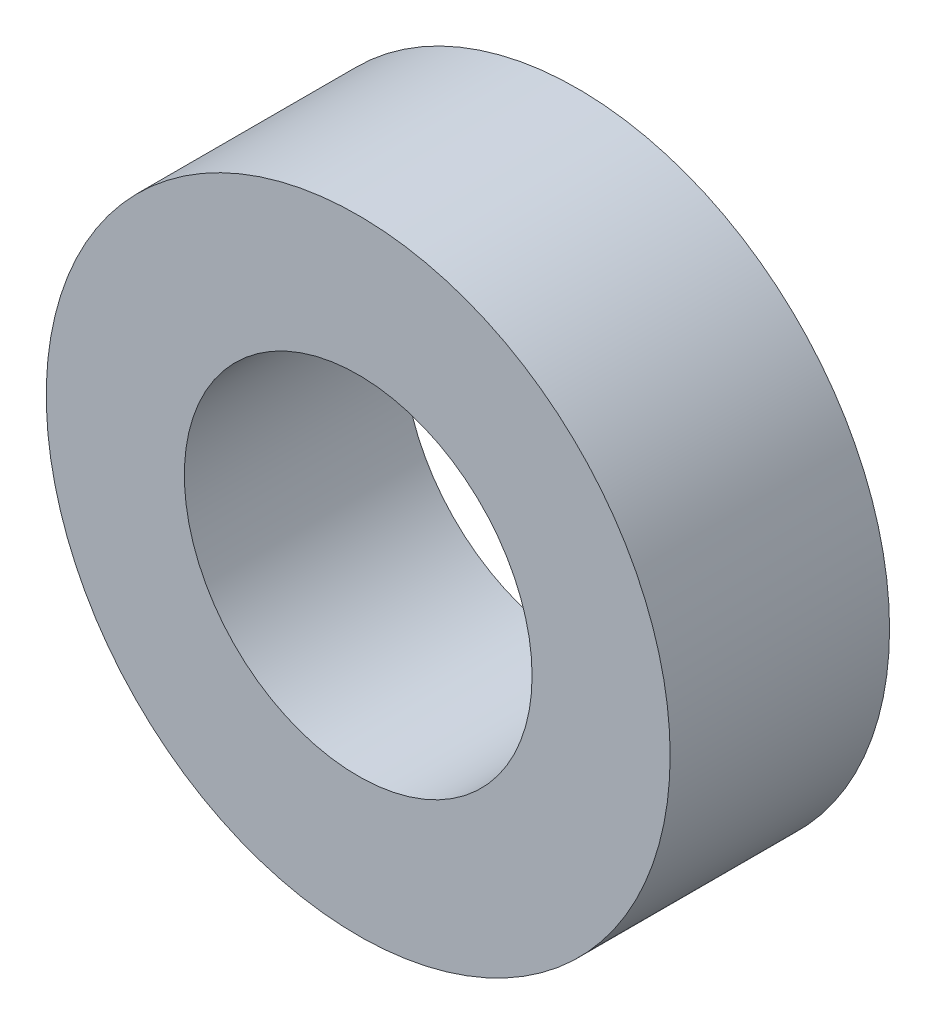
ISO-10303-21;
HEADER;
FILE_DESCRIPTION(('STEP AP214'),'2;1');
FILE_NAME('part.step','',(''),(''),'','','');
FILE_SCHEMA(('AUTOMOTIVE_DESIGN { 1 0 10303 214 1 1 1 1 }'));
ENDSEC;
DATA;
#1=APPLICATION_CONTEXT('core data for automotive mechanical design processes');
#2=APPLICATION_PROTOCOL_DEFINITION('international standard','automotive_design',2000,#1);
#3=PRODUCT_CONTEXT('',#1,'mechanical');
#4=PRODUCT('Part','Part','',(#3));
#5=PRODUCT_RELATED_PRODUCT_CATEGORY('part','',(#4));
#6=PRODUCT_DEFINITION_FORMATION('','',#4);
#7=PRODUCT_DEFINITION_CONTEXT('part definition',#1,'design');
#8=PRODUCT_DEFINITION('design','',#6,#7);
#9=PRODUCT_DEFINITION_SHAPE('','',#8);
#10=(LENGTH_UNIT() NAMED_UNIT(*) SI_UNIT(.MILLI.,.METRE.));
#11=(NAMED_UNIT(*) PLANE_ANGLE_UNIT() SI_UNIT($,.RADIAN.));
#12=(NAMED_UNIT(*) SI_UNIT($,.STERADIAN.) SOLID_ANGLE_UNIT());
#13=UNCERTAINTY_MEASURE_WITH_UNIT(LENGTH_MEASURE(1.E-05),#10,'distance_accuracy_value','');
#14=(GEOMETRIC_REPRESENTATION_CONTEXT(3) GLOBAL_UNCERTAINTY_ASSIGNED_CONTEXT((#13)) GLOBAL_UNIT_ASSIGNED_CONTEXT((#10,
#11,#12)) REPRESENTATION_CONTEXT('',''));
#15=CARTESIAN_POINT('',(0.,0.,0.));
#16=DIRECTION('',(0.,0.,1.));
#17=DIRECTION('',(1.,0.,0.));
#18=AXIS2_PLACEMENT_3D('',#15,#16,#17);
#19=CARTESIAN_POINT('',(0.,0.,50.8));
#20=DIRECTION('',(0.,0.,1.));
#21=DIRECTION('',(1.,0.,0.));
#22=AXIS2_PLACEMENT_3D('',#19,#20,#21);
#23=PLANE('',#22);
#24=CARTESIAN_POINT('',(0.,0.,50.8));
#25=DIRECTION('',(0.,0.,1.));
#26=DIRECTION('',(1.,0.,0.));
#27=AXIS2_PLACEMENT_3D('',#24,#25,#26);
#28=CIRCLE('',#27,72.23125);
#29=CARTESIAN_POINT('',(72.23125,0.,50.8));
#30=VERTEX_POINT('',#29);
#31=EDGE_CURVE('E10',#30,#30,#28,.T.);
#32=ORIENTED_EDGE('',*,*,#31,.T.);
#33=EDGE_LOOP('',(#32));
#34=FACE_BOUND('',#33,.T.);
#35=CARTESIAN_POINT('',(0.,0.,50.8));
#36=DIRECTION('',(0.,0.,1.));
#37=DIRECTION('',(1.,0.,0.));
#38=AXIS2_PLACEMENT_3D('',#35,#36,#37);
#39=CIRCLE('',#38,40.259);
#40=CARTESIAN_POINT('',(40.259,0.,50.8));
#41=VERTEX_POINT('',#40);
#42=EDGE_CURVE('E42',#41,#41,#39,.T.);
#43=ORIENTED_EDGE('',*,*,#42,.F.);
#44=EDGE_LOOP('',(#43));
#45=FACE_BOUND('',#44,.T.);
#46=ADVANCED_FACE('F31',(#34,#45),#23,.T.);
#47=CARTESIAN_POINT('',(0.,0.,0.));
#48=DIRECTION('',(0.,0.,1.));
#49=DIRECTION('',(1.,0.,0.));
#50=AXIS2_PLACEMENT_3D('',#47,#48,#49);
#51=PLANE('',#50);
#52=CARTESIAN_POINT('',(0.,0.,0.));
#53=DIRECTION('',(0.,0.,1.));
#54=DIRECTION('',(1.,0.,0.));
#55=AXIS2_PLACEMENT_3D('',#52,#53,#54);
#56=CIRCLE('',#55,72.23125);
#57=CARTESIAN_POINT('',(72.23125,0.,0.));
#58=VERTEX_POINT('',#57);
#59=EDGE_CURVE('E35',#58,#58,#56,.T.);
#60=ORIENTED_EDGE('',*,*,#59,.F.);
#61=EDGE_LOOP('',(#60));
#62=FACE_BOUND('',#61,.T.);
#63=CARTESIAN_POINT('',(0.,0.,0.));
#64=DIRECTION('',(0.,0.,1.));
#65=DIRECTION('',(1.,0.,0.));
#66=AXIS2_PLACEMENT_3D('',#63,#64,#65);
#67=CIRCLE('',#66,40.259);
#68=CARTESIAN_POINT('',(40.259,0.,0.));
#69=VERTEX_POINT('',#68);
#70=EDGE_CURVE('E44',#69,#69,#67,.T.);
#71=ORIENTED_EDGE('',*,*,#70,.T.);
#72=EDGE_LOOP('',(#71));
#73=FACE_BOUND('',#72,.T.);
#74=ADVANCED_FACE('F54',(#62,#73),#51,.F.);
#75=CARTESIAN_POINT('',(0.,0.,50.8));
#76=DIRECTION('',(0.,0.,-1.));
#77=DIRECTION('',(-1.,0.,0.));
#78=AXIS2_PLACEMENT_3D('',#75,#76,#77);
#79=CYLINDRICAL_SURFACE('',#78,72.23125);
#80=ORIENTED_EDGE('',*,*,#31,.F.);
#81=EDGE_LOOP('',(#80));
#82=FACE_BOUND('',#81,.T.);
#83=ORIENTED_EDGE('',*,*,#59,.T.);
#84=EDGE_LOOP('',(#83));
#85=FACE_BOUND('',#84,.T.);
#86=ADVANCED_FACE('F33',(#82,#85),#79,.T.);
#87=CARTESIAN_POINT('',(0.,0.,50.8));
#88=DIRECTION('',(0.,0.,-1.));
#89=DIRECTION('',(-1.,0.,0.));
#90=AXIS2_PLACEMENT_3D('',#87,#88,#89);
#91=CYLINDRICAL_SURFACE('',#90,40.259);
#92=ORIENTED_EDGE('',*,*,#42,.T.);
#93=EDGE_LOOP('',(#92));
#94=FACE_BOUND('',#93,.T.);
#95=ORIENTED_EDGE('',*,*,#70,.F.);
#96=EDGE_LOOP('',(#95));
#97=FACE_BOUND('',#96,.T.);
#98=ADVANCED_FACE('F50',(#94,#97),#91,.F.);
#99=CLOSED_SHELL('',(#46,#74,#86,#98));
#100=MANIFOLD_SOLID_BREP('B2',#99);
#101=ADVANCED_BREP_SHAPE_REPRESENTATION('',(#18,#100),#14);
#102=SHAPE_DEFINITION_REPRESENTATION(#9,#101);
ENDSEC;
END-ISO-10303-21;
